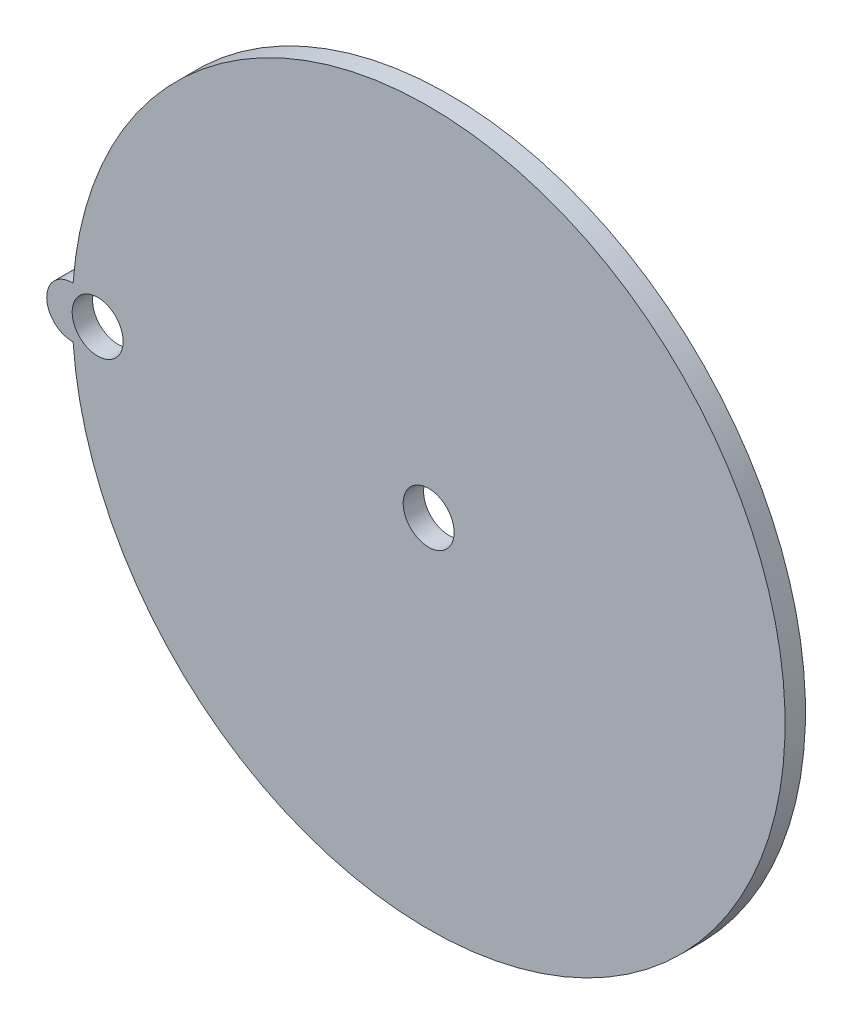
ISO-10303-21;
HEADER;
FILE_DESCRIPTION(('STEP AP214'),'2;1');
FILE_NAME('part.step','',(''),(''),'','','');
FILE_SCHEMA(('AUTOMOTIVE_DESIGN { 1 0 10303 214 1 1 1 1 }'));
ENDSEC;
DATA;
#1=APPLICATION_CONTEXT('core data for automotive mechanical design processes');
#2=APPLICATION_PROTOCOL_DEFINITION('international standard','automotive_design',2000,#1);
#3=PRODUCT_CONTEXT('',#1,'mechanical');
#4=PRODUCT('Part','Part','',(#3));
#5=PRODUCT_RELATED_PRODUCT_CATEGORY('part','',(#4));
#6=PRODUCT_DEFINITION_FORMATION('','',#4);
#7=PRODUCT_DEFINITION_CONTEXT('part definition',#1,'design');
#8=PRODUCT_DEFINITION('design','',#6,#7);
#9=PRODUCT_DEFINITION_SHAPE('','',#8);
#10=(LENGTH_UNIT() NAMED_UNIT(*) SI_UNIT(.MILLI.,.METRE.));
#11=(NAMED_UNIT(*) PLANE_ANGLE_UNIT() SI_UNIT($,.RADIAN.));
#12=(NAMED_UNIT(*) SI_UNIT($,.STERADIAN.) SOLID_ANGLE_UNIT());
#13=UNCERTAINTY_MEASURE_WITH_UNIT(LENGTH_MEASURE(1.E-05),#10,'distance_accuracy_value','');
#14=(GEOMETRIC_REPRESENTATION_CONTEXT(3) GLOBAL_UNCERTAINTY_ASSIGNED_CONTEXT((#13)) GLOBAL_UNIT_ASSIGNED_CONTEXT((#10,
#11,#12)) REPRESENTATION_CONTEXT('',''));
#15=CARTESIAN_POINT('',(0.,0.,0.));
#16=DIRECTION('',(0.,0.,1.));
#17=DIRECTION('',(1.,0.,0.));
#18=AXIS2_PLACEMENT_3D('',#15,#16,#17);
#19=CARTESIAN_POINT('',(-44.45,0.,2.54));
#20=DIRECTION('',(0.,0.,-1.));
#21=DIRECTION('',(-1.,0.,0.));
#22=AXIS2_PLACEMENT_3D('',#19,#20,#21);
#23=CYLINDRICAL_SURFACE('',#22,3.175);
#24=CARTESIAN_POINT('',(-44.45,0.,0.));
#25=DIRECTION('',(0.,0.,1.));
#26=DIRECTION('',(1.,0.,0.));
#27=AXIS2_PLACEMENT_3D('',#24,#25,#26);
#28=CIRCLE('',#27,3.175);
#29=CARTESIAN_POINT('',(-44.3366071428571,-3.17297448145252,0.));
#30=VERTEX_POINT('',#29);
#31=CARTESIAN_POINT('',(-44.3366071428571,3.17297448145252,0.));
#32=VERTEX_POINT('',#31);
#33=EDGE_CURVE('E64',#30,#32,#28,.F.);
#34=ORIENTED_EDGE('',*,*,#33,.F.);
#35=DIRECTION('',(0.,0.,-1.));
#36=VECTOR('',#35,1.);
#37=CARTESIAN_POINT('',(-44.3366071428571,-3.17297448145252,2.54));
#38=LINE('',#37,#36);
#39=CARTESIAN_POINT('',(-44.3366071428571,-3.17297448145252,2.54));
#40=VERTEX_POINT('',#39);
#41=EDGE_CURVE('E11',#40,#30,#38,.T.);
#42=ORIENTED_EDGE('',*,*,#41,.F.);
#43=CARTESIAN_POINT('',(-44.45,0.,2.54));
#44=DIRECTION('',(0.,0.,1.));
#45=DIRECTION('',(1.,0.,0.));
#46=AXIS2_PLACEMENT_3D('',#43,#44,#45);
#47=CIRCLE('',#46,3.175);
#48=CARTESIAN_POINT('',(-44.3366071428571,3.17297448145252,2.54));
#49=VERTEX_POINT('',#48);
#50=EDGE_CURVE('E65',#40,#49,#47,.F.);
#51=ORIENTED_EDGE('',*,*,#50,.T.);
#52=DIRECTION('',(0.,0.,-1.));
#53=VECTOR('',#52,1.);
#54=CARTESIAN_POINT('',(-44.3366071428571,3.17297448145252,2.54));
#55=LINE('',#54,#53);
#56=EDGE_CURVE('E44',#49,#32,#55,.T.);
#57=ORIENTED_EDGE('',*,*,#56,.T.);
#58=EDGE_LOOP('',(#34,#42,#51,#57));
#59=FACE_BOUND('',#58,.T.);
#60=ADVANCED_FACE('F36',(#59),#23,.T.);
#61=CARTESIAN_POINT('',(0.,0.,2.54));
#62=DIRECTION('',(0.,0.,-1.));
#63=DIRECTION('',(-1.,0.,0.));
#64=AXIS2_PLACEMENT_3D('',#61,#62,#63);
#65=CYLINDRICAL_SURFACE('',#64,3.175);
#66=CARTESIAN_POINT('',(0.,0.,2.54));
#67=DIRECTION('',(0.,0.,1.));
#68=DIRECTION('',(1.,0.,0.));
#69=AXIS2_PLACEMENT_3D('',#66,#67,#68);
#70=CIRCLE('',#69,3.175);
#71=CARTESIAN_POINT('',(3.175,0.,2.54));
#72=VERTEX_POINT('',#71);
#73=EDGE_CURVE('E85',#72,#72,#70,.T.);
#74=ORIENTED_EDGE('',*,*,#73,.T.);
#75=EDGE_LOOP('',(#74));
#76=FACE_BOUND('',#75,.T.);
#77=CARTESIAN_POINT('',(0.,0.,0.));
#78=DIRECTION('',(0.,0.,1.));
#79=DIRECTION('',(1.,0.,0.));
#80=AXIS2_PLACEMENT_3D('',#77,#78,#79);
#81=CIRCLE('',#80,3.175);
#82=CARTESIAN_POINT('',(3.175,0.,0.));
#83=VERTEX_POINT('',#82);
#84=EDGE_CURVE('E70',#83,#83,#81,.T.);
#85=ORIENTED_EDGE('',*,*,#84,.F.);
#86=EDGE_LOOP('',(#85));
#87=FACE_BOUND('',#86,.T.);
#88=ADVANCED_FACE('F107',(#76,#87),#65,.F.);
#89=CARTESIAN_POINT('',(0.,0.,2.54));
#90=DIRECTION('',(0.,0.,-1.));
#91=DIRECTION('',(-1.,0.,0.));
#92=AXIS2_PLACEMENT_3D('',#89,#90,#91);
#93=CYLINDRICAL_SURFACE('',#92,44.45);
#94=CARTESIAN_POINT('',(0.,0.,0.));
#95=DIRECTION('',(0.,0.,1.));
#96=DIRECTION('',(1.,0.,0.));
#97=AXIS2_PLACEMENT_3D('',#94,#95,#96);
#98=CIRCLE('',#97,44.45);
#99=EDGE_CURVE('E67',#30,#32,#98,.T.);
#100=ORIENTED_EDGE('',*,*,#99,.T.);
#101=ORIENTED_EDGE('',*,*,#56,.F.);
#102=CARTESIAN_POINT('',(0.,0.,2.54));
#103=DIRECTION('',(0.,0.,1.));
#104=DIRECTION('',(1.,0.,0.));
#105=AXIS2_PLACEMENT_3D('',#102,#103,#104);
#106=CIRCLE('',#105,44.45);
#107=EDGE_CURVE('E51',#40,#49,#106,.T.);
#108=ORIENTED_EDGE('',*,*,#107,.F.);
#109=ORIENTED_EDGE('',*,*,#41,.T.);
#110=EDGE_LOOP('',(#100,#101,#108,#109));
#111=FACE_BOUND('',#110,.T.);
#112=ADVANCED_FACE('F68',(#111),#93,.T.);
#113=CARTESIAN_POINT('',(-41.275,0.,2.54));
#114=DIRECTION('',(0.,0.,-1.));
#115=DIRECTION('',(-1.,0.,0.));
#116=AXIS2_PLACEMENT_3D('',#113,#114,#115);
#117=CYLINDRICAL_SURFACE('',#116,3.17500000000001);
#118=CARTESIAN_POINT('',(-41.275,0.,2.54));
#119=DIRECTION('',(0.,0.,1.));
#120=DIRECTION('',(1.,0.,0.));
#121=AXIS2_PLACEMENT_3D('',#118,#119,#120);
#122=CIRCLE('',#121,3.17500000000001);
#123=CARTESIAN_POINT('',(-38.1,0.,2.54));
#124=VERTEX_POINT('',#123);
#125=EDGE_CURVE('E66',#124,#124,#122,.T.);
#126=ORIENTED_EDGE('',*,*,#125,.T.);
#127=EDGE_LOOP('',(#126));
#128=FACE_BOUND('',#127,.T.);
#129=CARTESIAN_POINT('',(-41.275,0.,0.));
#130=DIRECTION('',(0.,0.,1.));
#131=DIRECTION('',(1.,0.,0.));
#132=AXIS2_PLACEMENT_3D('',#129,#130,#131);
#133=CIRCLE('',#132,3.17500000000001);
#134=CARTESIAN_POINT('',(-38.1,0.,0.));
#135=VERTEX_POINT('',#134);
#136=EDGE_CURVE('E80',#135,#135,#133,.T.);
#137=ORIENTED_EDGE('',*,*,#136,.F.);
#138=EDGE_LOOP('',(#137));
#139=FACE_BOUND('',#138,.T.);
#140=ADVANCED_FACE('F93',(#128,#139),#117,.F.);
#141=CARTESIAN_POINT('',(0.,0.,2.54));
#142=DIRECTION('',(0.,0.,1.));
#143=DIRECTION('',(1.,0.,0.));
#144=AXIS2_PLACEMENT_3D('',#141,#142,#143);
#145=PLANE('',#144);
#146=ORIENTED_EDGE('',*,*,#50,.F.);
#147=ORIENTED_EDGE('',*,*,#107,.T.);
#148=EDGE_LOOP('',(#146,#147));
#149=FACE_BOUND('',#148,.T.);
#150=ORIENTED_EDGE('',*,*,#73,.F.);
#151=EDGE_LOOP('',(#150));
#152=FACE_BOUND('',#151,.T.);
#153=ORIENTED_EDGE('',*,*,#125,.F.);
#154=EDGE_LOOP('',(#153));
#155=FACE_BOUND('',#154,.T.);
#156=ADVANCED_FACE('F96',(#149,#152,#155),#145,.T.);
#157=CARTESIAN_POINT('',(0.,0.,0.));
#158=DIRECTION('',(0.,0.,1.));
#159=DIRECTION('',(1.,0.,0.));
#160=AXIS2_PLACEMENT_3D('',#157,#158,#159);
#161=PLANE('',#160);
#162=ORIENTED_EDGE('',*,*,#33,.T.);
#163=ORIENTED_EDGE('',*,*,#99,.F.);
#164=EDGE_LOOP('',(#162,#163));
#165=FACE_BOUND('',#164,.T.);
#166=ORIENTED_EDGE('',*,*,#84,.T.);
#167=EDGE_LOOP('',(#166));
#168=FACE_BOUND('',#167,.T.);
#169=ORIENTED_EDGE('',*,*,#136,.T.);
#170=EDGE_LOOP('',(#169));
#171=FACE_BOUND('',#170,.T.);
#172=ADVANCED_FACE('F72',(#165,#168,#171),#161,.F.);
#173=CLOSED_SHELL('',(#60,#88,#112,#140,#156,#172));
#174=MANIFOLD_SOLID_BREP('B2',#173);
#175=ADVANCED_BREP_SHAPE_REPRESENTATION('',(#18,#174),#14);
#176=SHAPE_DEFINITION_REPRESENTATION(#9,#175);
ENDSEC;
END-ISO-10303-21;
